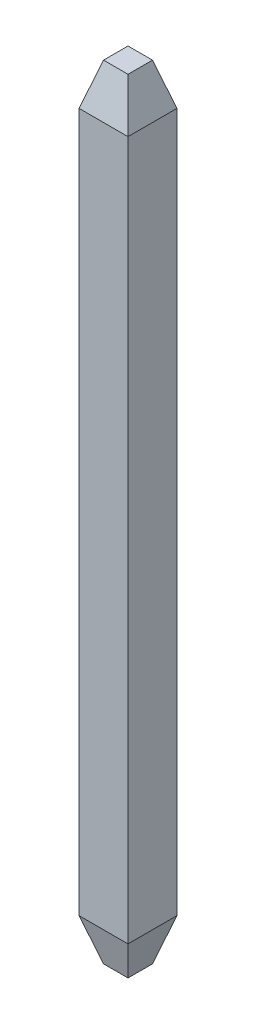
ISO-10303-21;
HEADER;
FILE_DESCRIPTION(('STEP AP214'),'2;1');
FILE_NAME('part.step','',(''),(''),'','','');
FILE_SCHEMA(('AUTOMOTIVE_DESIGN { 1 0 10303 214 1 1 1 1 }'));
ENDSEC;
DATA;
#1=APPLICATION_CONTEXT('core data for automotive mechanical design processes');
#2=APPLICATION_PROTOCOL_DEFINITION('international standard','automotive_design',2000,#1);
#3=PRODUCT_CONTEXT('',#1,'mechanical');
#4=PRODUCT('Part','Part','',(#3));
#5=PRODUCT_RELATED_PRODUCT_CATEGORY('part','',(#4));
#6=PRODUCT_DEFINITION_FORMATION('','',#4);
#7=PRODUCT_DEFINITION_CONTEXT('part definition',#1,'design');
#8=PRODUCT_DEFINITION('design','',#6,#7);
#9=PRODUCT_DEFINITION_SHAPE('','',#8);
#10=(LENGTH_UNIT() NAMED_UNIT(*) SI_UNIT(.MILLI.,.METRE.));
#11=(NAMED_UNIT(*) PLANE_ANGLE_UNIT() SI_UNIT($,.RADIAN.));
#12=(NAMED_UNIT(*) SI_UNIT($,.STERADIAN.) SOLID_ANGLE_UNIT());
#13=UNCERTAINTY_MEASURE_WITH_UNIT(LENGTH_MEASURE(1.E-05),#10,'distance_accuracy_value','');
#14=(GEOMETRIC_REPRESENTATION_CONTEXT(3) GLOBAL_UNCERTAINTY_ASSIGNED_CONTEXT((#13)) GLOBAL_UNIT_ASSIGNED_CONTEXT((#10,
#11,#12)) REPRESENTATION_CONTEXT('',''));
#15=CARTESIAN_POINT('',(0.,0.,0.));
#16=DIRECTION('',(0.,0.,1.));
#17=DIRECTION('',(1.,0.,0.));
#18=AXIS2_PLACEMENT_3D('',#15,#16,#17);
#19=CARTESIAN_POINT('',(3.97000000001295,-10.1039999999832,-17.2999999999763));
#20=DIRECTION('',(0.,-0.281214622974643,-0.959644900900968));
#21=DIRECTION('',(0.,-0.959644900900968,0.281214622974643));
#22=AXIS2_PLACEMENT_3D('',#19,#20,#21);
#23=PLANE('',#22);
#24=DIRECTION('',(1.,0.,0.));
#25=VECTOR('',#24,1.);
#26=CARTESIAN_POINT('',(3.65000000001294,-10.1039999999832,-17.2999999999763));
#27=LINE('',#26,#25);
#28=CARTESIAN_POINT('',(3.65000000001294,-10.1039999999832,-17.2999999999763));
#29=VERTEX_POINT('',#28);
#30=CARTESIAN_POINT('',(4.29000000001293,-10.1039999999832,-17.2999999999763));
#31=VERTEX_POINT('',#30);
#32=EDGE_CURVE('E11',#29,#31,#27,.T.);
#33=ORIENTED_EDGE('',*,*,#32,.T.);
#34=DIRECTION('',(-0.270714017147727,-0.923811583516618,0.270714017147727));
#35=VECTOR('',#34,1.);
#36=CARTESIAN_POINT('',(4.29000000001296,-10.1039999999832,-17.2999999999763));
#37=LINE('',#36,#35);
#38=CARTESIAN_POINT('',(4.13000000001293,-10.6499999999832,-17.1399999999763));
#39=VERTEX_POINT('',#38);
#40=EDGE_CURVE('E28',#31,#39,#37,.T.);
#41=ORIENTED_EDGE('',*,*,#40,.T.);
#42=DIRECTION('',(1.,0.,0.));
#43=VECTOR('',#42,1.);
#44=CARTESIAN_POINT('',(3.81000000001294,-10.6499999999832,-17.1399999999763));
#45=LINE('',#44,#43);
#46=CARTESIAN_POINT('',(3.81000000001294,-10.6499999999832,-17.1399999999763));
#47=VERTEX_POINT('',#46);
#48=EDGE_CURVE('E137',#47,#39,#45,.T.);
#49=ORIENTED_EDGE('',*,*,#48,.F.);
#50=DIRECTION('',(0.270714017147727,-0.923811583516618,0.270714017147727));
#51=VECTOR('',#50,1.);
#52=CARTESIAN_POINT('',(3.65000000001294,-10.1039999999832,-17.2999999999763));
#53=LINE('',#52,#51);
#54=EDGE_CURVE('E152',#29,#47,#53,.T.);
#55=ORIENTED_EDGE('',*,*,#54,.F.);
#56=EDGE_LOOP('',(#33,#41,#49,#55));
#57=FACE_BOUND('',#56,.T.);
#58=ADVANCED_FACE('F17',(#57),#23,.T.);
#59=CARTESIAN_POINT('',(4.29100000001296,-5.53443505344793,-17.2999999999763));
#60=DIRECTION('',(0.,0.,-1.));
#61=DIRECTION('',(0.,-1.,0.));
#62=AXIS2_PLACEMENT_3D('',#59,#60,#61);
#63=PLANE('',#62);
#64=DIRECTION('',(0.,1.,0.));
#65=VECTOR('',#64,1.);
#66=CARTESIAN_POINT('',(4.29000000001296,-10.1039999999832,-17.2999999999763));
#67=LINE('',#66,#65);
#68=CARTESIAN_POINT('',(4.29000000001293,-0.965870106912663,-17.2999999999763));
#69=VERTEX_POINT('',#68);
#70=EDGE_CURVE('E42',#31,#69,#67,.T.);
#71=ORIENTED_EDGE('',*,*,#70,.F.);
#72=ORIENTED_EDGE('',*,*,#32,.F.);
#73=DIRECTION('',(0.,1.,0.));
#74=VECTOR('',#73,1.);
#75=CARTESIAN_POINT('',(3.65000000001294,-10.1039999999832,-17.2999999999763));
#76=LINE('',#75,#74);
#77=CARTESIAN_POINT('',(3.65000000001294,-0.965870106912663,-17.2999999999763));
#78=VERTEX_POINT('',#77);
#79=EDGE_CURVE('E159',#29,#78,#76,.T.);
#80=ORIENTED_EDGE('',*,*,#79,.T.);
#81=DIRECTION('',(1.,0.,0.));
#82=VECTOR('',#81,1.);
#83=CARTESIAN_POINT('',(3.65000000001294,-0.965870106912661,-17.2999999999763));
#84=LINE('',#83,#82);
#85=EDGE_CURVE('E135',#78,#69,#84,.T.);
#86=ORIENTED_EDGE('',*,*,#85,.T.);
#87=EDGE_LOOP('',(#71,#72,#80,#86));
#88=FACE_BOUND('',#87,.T.);
#89=ADVANCED_FACE('F252',(#88),#63,.T.);
#90=CARTESIAN_POINT('',(4.29000000001296,-11.0738701069127,-16.9799999999763));
#91=DIRECTION('',(1.,0.,0.));
#92=DIRECTION('',(0.,1.,0.));
#93=AXIS2_PLACEMENT_3D('',#90,#91,#92);
#94=PLANE('',#93);
#95=DIRECTION('',(0.,1.,0.));
#96=VECTOR('',#95,1.);
#97=CARTESIAN_POINT('',(4.29000000001296,-10.1039999999832,-16.6599999999763));
#98=LINE('',#97,#96);
#99=CARTESIAN_POINT('',(4.29000000001293,-10.1039999999832,-16.6599999999763));
#100=VERTEX_POINT('',#99);
#101=CARTESIAN_POINT('',(4.29000000001293,-0.965870106912663,-16.6599999999763));
#102=VERTEX_POINT('',#101);
#103=EDGE_CURVE('E167',#100,#102,#98,.T.);
#104=ORIENTED_EDGE('',*,*,#103,.F.);
#105=DIRECTION('',(0.,0.,1.));
#106=VECTOR('',#105,1.);
#107=CARTESIAN_POINT('',(4.29000000001296,-10.1039999999832,-17.2999999999763));
#108=LINE('',#107,#106);
#109=EDGE_CURVE('E141',#31,#100,#108,.T.);
#110=ORIENTED_EDGE('',*,*,#109,.F.);
#111=ORIENTED_EDGE('',*,*,#70,.T.);
#112=DIRECTION('',(0.,0.,1.));
#113=VECTOR('',#112,1.);
#114=CARTESIAN_POINT('',(4.29000000001296,-0.965870106912661,-17.2999999999763));
#115=LINE('',#114,#113);
#116=EDGE_CURVE('E123',#69,#102,#115,.T.);
#117=ORIENTED_EDGE('',*,*,#116,.T.);
#118=EDGE_LOOP('',(#104,#110,#111,#117));
#119=FACE_BOUND('',#118,.T.);
#120=ADVANCED_FACE('F246',(#119),#94,.T.);
#121=CARTESIAN_POINT('',(3.64900000001297,-5.53543505344793,-16.6599999999763));
#122=DIRECTION('',(0.,0.,1.));
#123=DIRECTION('',(1.,0.,0.));
#124=AXIS2_PLACEMENT_3D('',#121,#122,#123);
#125=PLANE('',#124);
#126=DIRECTION('',(0.,1.,0.));
#127=VECTOR('',#126,1.);
#128=CARTESIAN_POINT('',(3.65000000001294,-10.1039999999832,-16.6599999999763));
#129=LINE('',#128,#127);
#130=CARTESIAN_POINT('',(3.65000000001294,-10.1039999999832,-16.6599999999763));
#131=VERTEX_POINT('',#130);
#132=CARTESIAN_POINT('',(3.65000000001294,-0.965870106912663,-16.6599999999763));
#133=VERTEX_POINT('',#132);
#134=EDGE_CURVE('E108',#131,#133,#129,.T.);
#135=ORIENTED_EDGE('',*,*,#134,.F.);
#136=DIRECTION('',(-1.,0.,0.));
#137=VECTOR('',#136,1.);
#138=CARTESIAN_POINT('',(4.29000000001296,-10.1039999999832,-16.6599999999763));
#139=LINE('',#138,#137);
#140=EDGE_CURVE('E131',#100,#131,#139,.T.);
#141=ORIENTED_EDGE('',*,*,#140,.F.);
#142=ORIENTED_EDGE('',*,*,#103,.T.);
#143=DIRECTION('',(-1.,0.,0.));
#144=VECTOR('',#143,1.);
#145=CARTESIAN_POINT('',(4.29000000001296,-0.965870106912661,-16.6599999999763));
#146=LINE('',#145,#144);
#147=EDGE_CURVE('E163',#102,#133,#146,.T.);
#148=ORIENTED_EDGE('',*,*,#147,.T.);
#149=EDGE_LOOP('',(#135,#141,#142,#148));
#150=FACE_BOUND('',#149,.T.);
#151=ADVANCED_FACE('F251',(#150),#125,.T.);
#152=CARTESIAN_POINT('',(3.97000000001295,-0.965870106912661,-16.6599999999763));
#153=DIRECTION('',(0.,0.281214622974643,0.959644900900968));
#154=DIRECTION('',(1.,0.,0.));
#155=AXIS2_PLACEMENT_3D('',#152,#153,#154);
#156=PLANE('',#155);
#157=DIRECTION('',(-0.270714017147727,0.923811583516618,-0.270714017147727));
#158=VECTOR('',#157,1.);
#159=CARTESIAN_POINT('',(4.29000000001296,-0.965870106912661,-16.6599999999763));
#160=LINE('',#159,#158);
#161=CARTESIAN_POINT('',(4.13000000001293,-0.419870106912663,-16.8199999999763));
#162=VERTEX_POINT('',#161);
#163=EDGE_CURVE('E168',#102,#162,#160,.T.);
#164=ORIENTED_EDGE('',*,*,#163,.T.);
#165=DIRECTION('',(-1.,0.,0.));
#166=VECTOR('',#165,1.);
#167=CARTESIAN_POINT('',(4.13000000001296,-0.419870106912661,-16.8199999999763));
#168=LINE('',#167,#166);
#169=CARTESIAN_POINT('',(3.81000000001294,-0.419870106912663,-16.8199999999763));
#170=VERTEX_POINT('',#169);
#171=EDGE_CURVE('E114',#162,#170,#168,.T.);
#172=ORIENTED_EDGE('',*,*,#171,.T.);
#173=DIRECTION('',(0.270714017147727,0.923811583516618,-0.270714017147727));
#174=VECTOR('',#173,1.);
#175=CARTESIAN_POINT('',(3.65000000001294,-0.965870106912661,-16.6599999999763));
#176=LINE('',#175,#174);
#177=EDGE_CURVE('E155',#133,#170,#176,.T.);
#178=ORIENTED_EDGE('',*,*,#177,.F.);
#179=ORIENTED_EDGE('',*,*,#147,.F.);
#180=EDGE_LOOP('',(#164,#172,#178,#179));
#181=FACE_BOUND('',#180,.T.);
#182=ADVANCED_FACE('F330',(#181),#156,.T.);
#183=CARTESIAN_POINT('',(3.65000000001294,-0.965870106912661,-16.9799999999763));
#184=DIRECTION('',(-0.959644900900968,0.281214622974643,0.));
#185=DIRECTION('',(0.,0.,1.));
#186=AXIS2_PLACEMENT_3D('',#183,#184,#185);
#187=PLANE('',#186);
#188=ORIENTED_EDGE('',*,*,#177,.T.);
#189=DIRECTION('',(0.,0.,-1.));
#190=VECTOR('',#189,1.);
#191=CARTESIAN_POINT('',(3.81000000001294,-0.419870106912661,-16.8199999999763));
#192=LINE('',#191,#190);
#193=CARTESIAN_POINT('',(3.81000000001294,-0.419870106912663,-17.1399999999763));
#194=VERTEX_POINT('',#193);
#195=EDGE_CURVE('E153',#170,#194,#192,.T.);
#196=ORIENTED_EDGE('',*,*,#195,.T.);
#197=DIRECTION('',(0.270714017147727,0.923811583516618,0.270714017147727));
#198=VECTOR('',#197,1.);
#199=CARTESIAN_POINT('',(3.65000000001294,-0.965870106912661,-17.2999999999763));
#200=LINE('',#199,#198);
#201=EDGE_CURVE('E103',#78,#194,#200,.T.);
#202=ORIENTED_EDGE('',*,*,#201,.F.);
#203=DIRECTION('',(0.,0.,-1.));
#204=VECTOR('',#203,1.);
#205=CARTESIAN_POINT('',(3.65000000001294,-0.965870106912661,-16.6599999999763));
#206=LINE('',#205,#204);
#207=EDGE_CURVE('E144',#133,#78,#206,.T.);
#208=ORIENTED_EDGE('',*,*,#207,.F.);
#209=EDGE_LOOP('',(#188,#196,#202,#208));
#210=FACE_BOUND('',#209,.T.);
#211=ADVANCED_FACE('F315',(#210),#187,.T.);
#212=CARTESIAN_POINT('',(3.97000000001295,-0.419870106912661,-17.1409999999763));
#213=DIRECTION('',(0.,1.,0.));
#214=DIRECTION('',(1.,0.,0.));
#215=AXIS2_PLACEMENT_3D('',#212,#213,#214);
#216=PLANE('',#215);
#217=DIRECTION('',(1.,0.,0.));
#218=VECTOR('',#217,1.);
#219=CARTESIAN_POINT('',(3.81000000001294,-0.419870106912661,-17.1399999999763));
#220=LINE('',#219,#218);
#221=CARTESIAN_POINT('',(4.13000000001293,-0.419870106912663,-17.1399999999763));
#222=VERTEX_POINT('',#221);
#223=EDGE_CURVE('E98',#194,#222,#220,.T.);
#224=ORIENTED_EDGE('',*,*,#223,.F.);
#225=ORIENTED_EDGE('',*,*,#195,.F.);
#226=ORIENTED_EDGE('',*,*,#171,.F.);
#227=DIRECTION('',(0.,0.,1.));
#228=VECTOR('',#227,1.);
#229=CARTESIAN_POINT('',(4.13000000001296,-0.419870106912661,-17.1399999999763));
#230=LINE('',#229,#228);
#231=EDGE_CURVE('E111',#222,#162,#230,.T.);
#232=ORIENTED_EDGE('',*,*,#231,.F.);
#233=EDGE_LOOP('',(#224,#225,#226,#232));
#234=FACE_BOUND('',#233,.T.);
#235=ADVANCED_FACE('F112',(#234),#216,.T.);
#236=CARTESIAN_POINT('',(3.97000000001295,-10.1039999999832,-16.6599999999763));
#237=DIRECTION('',(0.,-0.281214622974643,0.959644900900968));
#238=DIRECTION('',(-1.,0.,0.));
#239=AXIS2_PLACEMENT_3D('',#236,#237,#238);
#240=PLANE('',#239);
#241=ORIENTED_EDGE('',*,*,#140,.T.);
#242=DIRECTION('',(0.270714017147727,-0.923811583516618,-0.270714017147727));
#243=VECTOR('',#242,1.);
#244=CARTESIAN_POINT('',(3.65000000001294,-10.1039999999832,-16.6599999999763));
#245=LINE('',#244,#243);
#246=CARTESIAN_POINT('',(3.81000000001294,-10.6499999999832,-16.8199999999763));
#247=VERTEX_POINT('',#246);
#248=EDGE_CURVE('E125',#131,#247,#245,.T.);
#249=ORIENTED_EDGE('',*,*,#248,.T.);
#250=DIRECTION('',(-1.,0.,0.));
#251=VECTOR('',#250,1.);
#252=CARTESIAN_POINT('',(4.13000000001296,-10.6499999999832,-16.8199999999763));
#253=LINE('',#252,#251);
#254=CARTESIAN_POINT('',(4.13000000001293,-10.6499999999832,-16.8199999999763));
#255=VERTEX_POINT('',#254);
#256=EDGE_CURVE('E90',#255,#247,#253,.T.);
#257=ORIENTED_EDGE('',*,*,#256,.F.);
#258=DIRECTION('',(-0.270714017147727,-0.923811583516618,-0.270714017147727));
#259=VECTOR('',#258,1.);
#260=CARTESIAN_POINT('',(4.29000000001296,-10.1039999999832,-16.6599999999763));
#261=LINE('',#260,#259);
#262=EDGE_CURVE('E21',#100,#255,#261,.T.);
#263=ORIENTED_EDGE('',*,*,#262,.F.);
#264=EDGE_LOOP('',(#241,#249,#257,#263));
#265=FACE_BOUND('',#264,.T.);
#266=ADVANCED_FACE('F306',(#265),#240,.T.);
#267=CARTESIAN_POINT('',(4.29000000001296,-0.965870106912661,-16.9799999999763));
#268=DIRECTION('',(0.959644900900968,0.281214622974643,0.));
#269=DIRECTION('',(0.,0.,-1.));
#270=AXIS2_PLACEMENT_3D('',#267,#268,#269);
#271=PLANE('',#270);
#272=DIRECTION('',(-0.270714017147727,0.923811583516618,0.270714017147727));
#273=VECTOR('',#272,1.);
#274=CARTESIAN_POINT('',(4.29000000001296,-0.965870106912661,-17.2999999999763));
#275=LINE('',#274,#273);
#276=EDGE_CURVE('E102',#69,#222,#275,.T.);
#277=ORIENTED_EDGE('',*,*,#276,.T.);
#278=ORIENTED_EDGE('',*,*,#231,.T.);
#279=ORIENTED_EDGE('',*,*,#163,.F.);
#280=ORIENTED_EDGE('',*,*,#116,.F.);
#281=EDGE_LOOP('',(#277,#278,#279,#280));
#282=FACE_BOUND('',#281,.T.);
#283=ADVANCED_FACE('F121',(#282),#271,.T.);
#284=CARTESIAN_POINT('',(3.97000000001295,-0.965870106912661,-17.2999999999763));
#285=DIRECTION('',(0.,0.281214622974643,-0.959644900900968));
#286=DIRECTION('',(-1.,0.,0.));
#287=AXIS2_PLACEMENT_3D('',#284,#285,#286);
#288=PLANE('',#287);
#289=ORIENTED_EDGE('',*,*,#201,.T.);
#290=ORIENTED_EDGE('',*,*,#223,.T.);
#291=ORIENTED_EDGE('',*,*,#276,.F.);
#292=ORIENTED_EDGE('',*,*,#85,.F.);
#293=EDGE_LOOP('',(#289,#290,#291,#292));
#294=FACE_BOUND('',#293,.T.);
#295=ADVANCED_FACE('F19',(#294),#288,.T.);
#296=CARTESIAN_POINT('',(3.65000000001294,-5.53543505344793,-16.6589999999763));
#297=DIRECTION('',(-1.,0.,0.));
#298=DIRECTION('',(0.,0.,1.));
#299=AXIS2_PLACEMENT_3D('',#296,#297,#298);
#300=PLANE('',#299);
#301=ORIENTED_EDGE('',*,*,#79,.F.);
#302=DIRECTION('',(0.,0.,-1.));
#303=VECTOR('',#302,1.);
#304=CARTESIAN_POINT('',(3.65000000001294,-10.1039999999832,-16.6599999999763));
#305=LINE('',#304,#303);
#306=EDGE_CURVE('E148',#131,#29,#305,.T.);
#307=ORIENTED_EDGE('',*,*,#306,.F.);
#308=ORIENTED_EDGE('',*,*,#134,.T.);
#309=ORIENTED_EDGE('',*,*,#207,.T.);
#310=EDGE_LOOP('',(#301,#307,#308,#309));
#311=FACE_BOUND('',#310,.T.);
#312=ADVANCED_FACE('F274',(#311),#300,.T.);
#313=CARTESIAN_POINT('',(3.65000000001294,-10.1039999999832,-16.9799999999763));
#314=DIRECTION('',(-0.959644900900968,-0.281214622974643,0.));
#315=DIRECTION('',(-0.281214622974643,0.959644900900968,0.));
#316=AXIS2_PLACEMENT_3D('',#313,#314,#315);
#317=PLANE('',#316);
#318=ORIENTED_EDGE('',*,*,#306,.T.);
#319=ORIENTED_EDGE('',*,*,#54,.T.);
#320=DIRECTION('',(0.,0.,-1.));
#321=VECTOR('',#320,1.);
#322=CARTESIAN_POINT('',(3.81000000001294,-10.6499999999832,-16.8199999999763));
#323=LINE('',#322,#321);
#324=EDGE_CURVE('E140',#247,#47,#323,.T.);
#325=ORIENTED_EDGE('',*,*,#324,.F.);
#326=ORIENTED_EDGE('',*,*,#248,.F.);
#327=EDGE_LOOP('',(#318,#319,#325,#326));
#328=FACE_BOUND('',#327,.T.);
#329=ADVANCED_FACE('F265',(#328),#317,.T.);
#330=CARTESIAN_POINT('',(3.80900000001296,-10.6499999999832,-16.9799999999763));
#331=DIRECTION('',(0.,-1.,0.));
#332=DIRECTION('',(0.,0.,-1.));
#333=AXIS2_PLACEMENT_3D('',#330,#331,#332);
#334=PLANE('',#333);
#335=DIRECTION('',(0.,0.,1.));
#336=VECTOR('',#335,1.);
#337=CARTESIAN_POINT('',(4.13000000001296,-10.6499999999832,-17.1399999999763));
#338=LINE('',#337,#336);
#339=EDGE_CURVE('E183',#39,#255,#338,.T.);
#340=ORIENTED_EDGE('',*,*,#339,.T.);
#341=ORIENTED_EDGE('',*,*,#256,.T.);
#342=ORIENTED_EDGE('',*,*,#324,.T.);
#343=ORIENTED_EDGE('',*,*,#48,.T.);
#344=EDGE_LOOP('',(#340,#341,#342,#343));
#345=FACE_BOUND('',#344,.T.);
#346=ADVANCED_FACE('F259',(#345),#334,.T.);
#347=CARTESIAN_POINT('',(4.29000000001296,-10.1039999999832,-16.9799999999763));
#348=DIRECTION('',(0.959644900900968,-0.281214622974643,0.));
#349=DIRECTION('',(0.,0.,-1.));
#350=AXIS2_PLACEMENT_3D('',#347,#348,#349);
#351=PLANE('',#350);
#352=ORIENTED_EDGE('',*,*,#109,.T.);
#353=ORIENTED_EDGE('',*,*,#262,.T.);
#354=ORIENTED_EDGE('',*,*,#339,.F.);
#355=ORIENTED_EDGE('',*,*,#40,.F.);
#356=EDGE_LOOP('',(#352,#353,#354,#355));
#357=FACE_BOUND('',#356,.T.);
#358=ADVANCED_FACE('F264',(#357),#351,.T.);
#359=CLOSED_SHELL('',(#58,#89,#120,#151,#182,#211,#235,#266,#283,#295,#312,#329,#346,#358));
#360=MANIFOLD_SOLID_BREP('B1',#359);
#361=ADVANCED_BREP_SHAPE_REPRESENTATION('',(#18,#360),#14);
#362=SHAPE_DEFINITION_REPRESENTATION(#9,#361);
ENDSEC;
END-ISO-10303-21;
